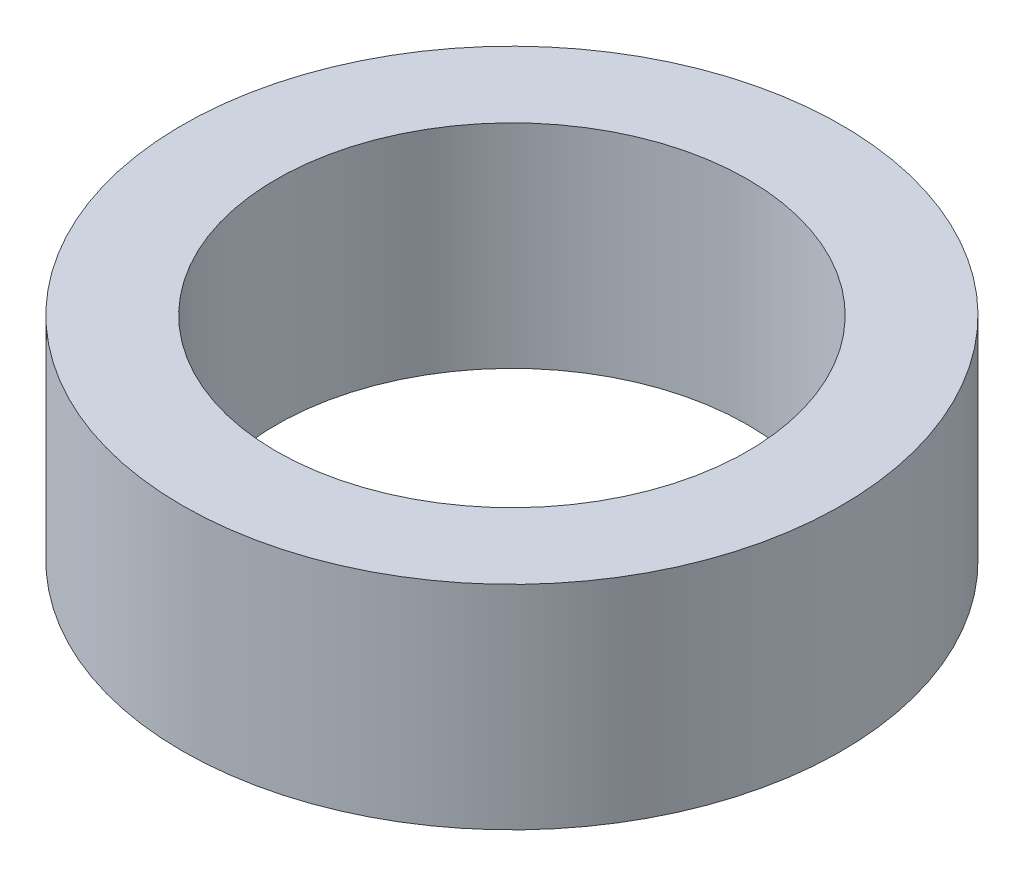
ISO-10303-21;
HEADER;
FILE_DESCRIPTION(('STEP AP214'),'2;1');
FILE_NAME('part.step','',(''),(''),'','','');
FILE_SCHEMA(('AUTOMOTIVE_DESIGN { 1 0 10303 214 1 1 1 1 }'));
ENDSEC;
DATA;
#1=APPLICATION_CONTEXT('core data for automotive mechanical design processes');
#2=APPLICATION_PROTOCOL_DEFINITION('international standard','automotive_design',2000,#1);
#3=PRODUCT_CONTEXT('',#1,'mechanical');
#4=PRODUCT('Part','Part','',(#3));
#5=PRODUCT_RELATED_PRODUCT_CATEGORY('part','',(#4));
#6=PRODUCT_DEFINITION_FORMATION('','',#4);
#7=PRODUCT_DEFINITION_CONTEXT('part definition',#1,'design');
#8=PRODUCT_DEFINITION('design','',#6,#7);
#9=PRODUCT_DEFINITION_SHAPE('','',#8);
#10=(LENGTH_UNIT() NAMED_UNIT(*) SI_UNIT(.MILLI.,.METRE.));
#11=(NAMED_UNIT(*) PLANE_ANGLE_UNIT() SI_UNIT($,.RADIAN.));
#12=(NAMED_UNIT(*) SI_UNIT($,.STERADIAN.) SOLID_ANGLE_UNIT());
#13=UNCERTAINTY_MEASURE_WITH_UNIT(LENGTH_MEASURE(1.E-05),#10,'distance_accuracy_value','');
#14=(GEOMETRIC_REPRESENTATION_CONTEXT(3) GLOBAL_UNCERTAINTY_ASSIGNED_CONTEXT((#13)) GLOBAL_UNIT_ASSIGNED_CONTEXT((#10,
#11,#12)) REPRESENTATION_CONTEXT('',''));
#15=CARTESIAN_POINT('',(0.,0.,0.));
#16=DIRECTION('',(0.,0.,1.));
#17=DIRECTION('',(1.,0.,0.));
#18=AXIS2_PLACEMENT_3D('',#15,#16,#17);
#19=CARTESIAN_POINT('',(0.,3.,0.));
#20=DIRECTION('',(0.,1.,0.));
#21=DIRECTION('',(0.,0.,1.));
#22=AXIS2_PLACEMENT_3D('',#19,#20,#21);
#23=PLANE('',#22);
#24=CARTESIAN_POINT('',(0.,3.,0.));
#25=DIRECTION('',(0.,1.,0.));
#26=DIRECTION('',(0.,0.,1.));
#27=AXIS2_PLACEMENT_3D('',#24,#25,#26);
#28=CIRCLE('',#27,4.65);
#29=CARTESIAN_POINT('',(0.,3.,4.65));
#30=VERTEX_POINT('',#29);
#31=EDGE_CURVE('E10',#30,#30,#28,.T.);
#32=ORIENTED_EDGE('',*,*,#31,.T.);
#33=EDGE_LOOP('',(#32));
#34=FACE_BOUND('',#33,.T.);
#35=CARTESIAN_POINT('',(0.,3.,0.));
#36=DIRECTION('',(0.,1.,0.));
#37=DIRECTION('',(0.,0.,1.));
#38=AXIS2_PLACEMENT_3D('',#35,#36,#37);
#39=CIRCLE('',#38,3.325);
#40=CARTESIAN_POINT('',(0.,3.,3.325));
#41=VERTEX_POINT('',#40);
#42=EDGE_CURVE('E42',#41,#41,#39,.T.);
#43=ORIENTED_EDGE('',*,*,#42,.F.);
#44=EDGE_LOOP('',(#43));
#45=FACE_BOUND('',#44,.T.);
#46=ADVANCED_FACE('F31',(#34,#45),#23,.T.);
#47=CARTESIAN_POINT('',(0.,0.,0.));
#48=DIRECTION('',(0.,1.,0.));
#49=DIRECTION('',(0.,0.,1.));
#50=AXIS2_PLACEMENT_3D('',#47,#48,#49);
#51=PLANE('',#50);
#52=CARTESIAN_POINT('',(0.,0.,0.));
#53=DIRECTION('',(0.,1.,0.));
#54=DIRECTION('',(0.,0.,1.));
#55=AXIS2_PLACEMENT_3D('',#52,#53,#54);
#56=CIRCLE('',#55,4.65);
#57=CARTESIAN_POINT('',(0.,0.,4.65));
#58=VERTEX_POINT('',#57);
#59=EDGE_CURVE('E35',#58,#58,#56,.T.);
#60=ORIENTED_EDGE('',*,*,#59,.F.);
#61=EDGE_LOOP('',(#60));
#62=FACE_BOUND('',#61,.T.);
#63=CARTESIAN_POINT('',(0.,0.,0.));
#64=DIRECTION('',(0.,1.,0.));
#65=DIRECTION('',(0.,0.,1.));
#66=AXIS2_PLACEMENT_3D('',#63,#64,#65);
#67=CIRCLE('',#66,3.325);
#68=CARTESIAN_POINT('',(0.,0.,3.325));
#69=VERTEX_POINT('',#68);
#70=EDGE_CURVE('E44',#69,#69,#67,.T.);
#71=ORIENTED_EDGE('',*,*,#70,.T.);
#72=EDGE_LOOP('',(#71));
#73=FACE_BOUND('',#72,.T.);
#74=ADVANCED_FACE('F54',(#62,#73),#51,.F.);
#75=CARTESIAN_POINT('',(0.,3.,0.));
#76=DIRECTION('',(0.,-1.,0.));
#77=DIRECTION('',(0.,0.,-1.));
#78=AXIS2_PLACEMENT_3D('',#75,#76,#77);
#79=CYLINDRICAL_SURFACE('',#78,4.65);
#80=ORIENTED_EDGE('',*,*,#31,.F.);
#81=EDGE_LOOP('',(#80));
#82=FACE_BOUND('',#81,.T.);
#83=ORIENTED_EDGE('',*,*,#59,.T.);
#84=EDGE_LOOP('',(#83));
#85=FACE_BOUND('',#84,.T.);
#86=ADVANCED_FACE('F33',(#82,#85),#79,.T.);
#87=CARTESIAN_POINT('',(0.,3.,0.));
#88=DIRECTION('',(0.,-1.,0.));
#89=DIRECTION('',(0.,0.,-1.));
#90=AXIS2_PLACEMENT_3D('',#87,#88,#89);
#91=CYLINDRICAL_SURFACE('',#90,3.325);
#92=ORIENTED_EDGE('',*,*,#42,.T.);
#93=EDGE_LOOP('',(#92));
#94=FACE_BOUND('',#93,.T.);
#95=ORIENTED_EDGE('',*,*,#70,.F.);
#96=EDGE_LOOP('',(#95));
#97=FACE_BOUND('',#96,.T.);
#98=ADVANCED_FACE('F50',(#94,#97),#91,.F.);
#99=CLOSED_SHELL('',(#46,#74,#86,#98));
#100=MANIFOLD_SOLID_BREP('B2',#99);
#101=ADVANCED_BREP_SHAPE_REPRESENTATION('',(#18,#100),#14);
#102=SHAPE_DEFINITION_REPRESENTATION(#9,#101);
ENDSEC;
END-ISO-10303-21;
